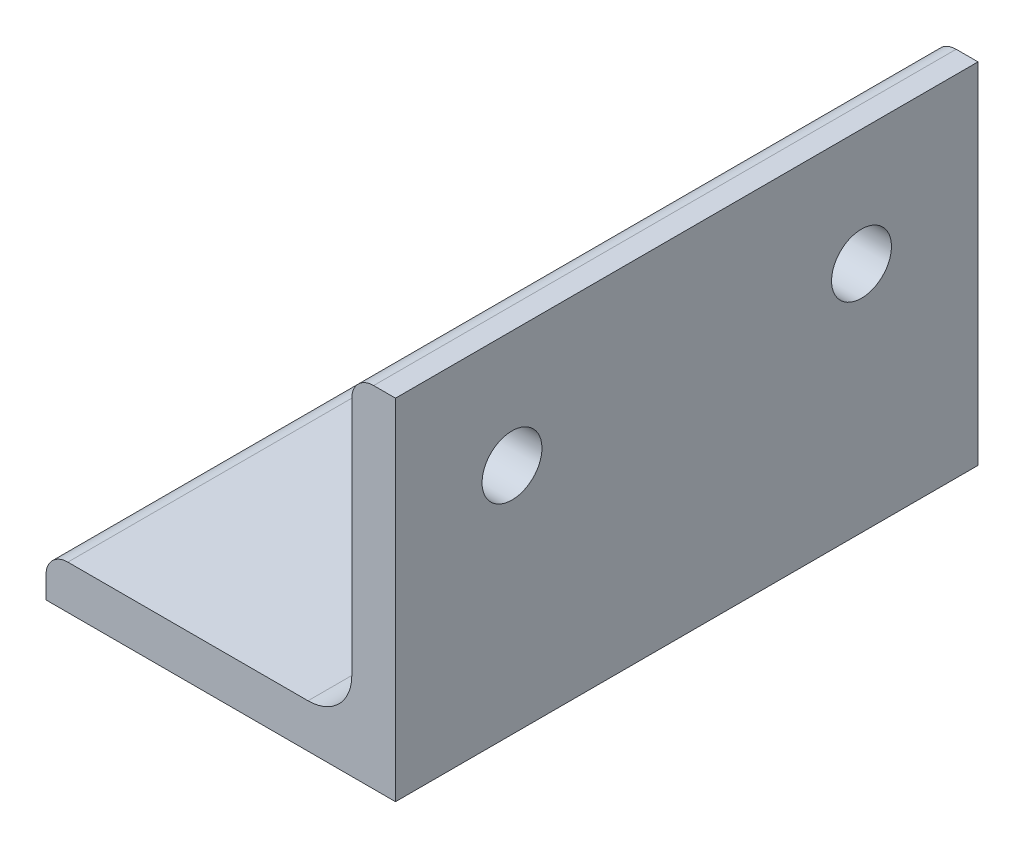
ISO-10303-21;
HEADER;
FILE_DESCRIPTION(('STEP AP214'),'2;1');
FILE_NAME('part.step','',(''),(''),'','','');
FILE_SCHEMA(('AUTOMOTIVE_DESIGN { 1 0 10303 214 1 1 1 1 }'));
ENDSEC;
DATA;
#1=APPLICATION_CONTEXT('core data for automotive mechanical design processes');
#2=APPLICATION_PROTOCOL_DEFINITION('international standard','automotive_design',2000,#1);
#3=PRODUCT_CONTEXT('',#1,'mechanical');
#4=PRODUCT('Part','Part','',(#3));
#5=PRODUCT_RELATED_PRODUCT_CATEGORY('part','',(#4));
#6=PRODUCT_DEFINITION_FORMATION('','',#4);
#7=PRODUCT_DEFINITION_CONTEXT('part definition',#1,'design');
#8=PRODUCT_DEFINITION('design','',#6,#7);
#9=PRODUCT_DEFINITION_SHAPE('','',#8);
#10=(LENGTH_UNIT() NAMED_UNIT(*) SI_UNIT(.MILLI.,.METRE.));
#11=(NAMED_UNIT(*) PLANE_ANGLE_UNIT() SI_UNIT($,.RADIAN.));
#12=(NAMED_UNIT(*) SI_UNIT($,.STERADIAN.) SOLID_ANGLE_UNIT());
#13=UNCERTAINTY_MEASURE_WITH_UNIT(LENGTH_MEASURE(1.E-05),#10,'distance_accuracy_value','');
#14=(GEOMETRIC_REPRESENTATION_CONTEXT(3) GLOBAL_UNCERTAINTY_ASSIGNED_CONTEXT((#13)) GLOBAL_UNIT_ASSIGNED_CONTEXT((#10,
#11,#12)) REPRESENTATION_CONTEXT('',''));
#15=CARTESIAN_POINT('',(0.,0.,0.));
#16=DIRECTION('',(0.,0.,1.));
#17=DIRECTION('',(1.,0.,0.));
#18=AXIS2_PLACEMENT_3D('',#15,#16,#17);
#19=CARTESIAN_POINT('',(-19.05,-16.66875,31.75));
#20=DIRECTION('',(1.,0.,0.));
#21=DIRECTION('',(0.,0.,-1.));
#22=AXIS2_PLACEMENT_3D('',#19,#20,#21);
#23=PLANE('',#22);
#24=DIRECTION('',(0.,-1.,0.));
#25=VECTOR('',#24,1.);
#26=CARTESIAN_POINT('',(-19.05,-16.66875,-31.75));
#27=LINE('',#26,#25);
#28=CARTESIAN_POINT('',(-19.05,-16.66875,-31.75));
#29=VERTEX_POINT('',#28);
#30=CARTESIAN_POINT('',(-19.05,-19.05,-31.75));
#31=VERTEX_POINT('',#30);
#32=EDGE_CURVE('E136',#29,#31,#27,.T.);
#33=ORIENTED_EDGE('',*,*,#32,.T.);
#34=DIRECTION('',(0.,0.,-1.));
#35=VECTOR('',#34,1.);
#36=CARTESIAN_POINT('',(-19.05,-19.05,31.75));
#37=LINE('',#36,#35);
#38=CARTESIAN_POINT('',(-19.05,-19.05,31.75));
#39=VERTEX_POINT('',#38);
#40=EDGE_CURVE('E11',#39,#31,#37,.T.);
#41=ORIENTED_EDGE('',*,*,#40,.F.);
#42=DIRECTION('',(0.,-1.,0.));
#43=VECTOR('',#42,1.);
#44=CARTESIAN_POINT('',(-19.05,-16.66875,31.75));
#45=LINE('',#44,#43);
#46=CARTESIAN_POINT('',(-19.05,-16.66875,31.75));
#47=VERTEX_POINT('',#46);
#48=EDGE_CURVE('E153',#47,#39,#45,.T.);
#49=ORIENTED_EDGE('',*,*,#48,.F.);
#50=DIRECTION('',(0.,0.,-1.));
#51=VECTOR('',#50,1.);
#52=CARTESIAN_POINT('',(-19.05,-16.66875,31.75));
#53=LINE('',#52,#51);
#54=EDGE_CURVE('E132',#47,#29,#53,.T.);
#55=ORIENTED_EDGE('',*,*,#54,.T.);
#56=EDGE_LOOP('',(#33,#41,#49,#55));
#57=FACE_BOUND('',#56,.T.);
#58=ADVANCED_FACE('F34',(#57),#23,.F.);
#59=CARTESIAN_POINT('',(-19.05,-19.05,31.75));
#60=DIRECTION('',(0.,1.,0.));
#61=DIRECTION('',(-1.,0.,0.));
#62=AXIS2_PLACEMENT_3D('',#59,#60,#61);
#63=PLANE('',#62);
#64=DIRECTION('',(1.,0.,0.));
#65=VECTOR('',#64,1.);
#66=CARTESIAN_POINT('',(-19.05,-19.05,-31.75));
#67=LINE('',#66,#65);
#68=CARTESIAN_POINT('',(19.05,-19.05,-31.75));
#69=VERTEX_POINT('',#68);
#70=EDGE_CURVE('E139',#31,#69,#67,.T.);
#71=ORIENTED_EDGE('',*,*,#70,.T.);
#72=DIRECTION('',(0.,0.,-1.));
#73=VECTOR('',#72,1.);
#74=CARTESIAN_POINT('',(19.05,-19.05,31.75));
#75=LINE('',#74,#73);
#76=CARTESIAN_POINT('',(19.05,-19.05,31.75));
#77=VERTEX_POINT('',#76);
#78=EDGE_CURVE('E42',#77,#69,#75,.T.);
#79=ORIENTED_EDGE('',*,*,#78,.F.);
#80=DIRECTION('',(1.,0.,0.));
#81=VECTOR('',#80,1.);
#82=CARTESIAN_POINT('',(-19.05,-19.05,31.75));
#83=LINE('',#82,#81);
#84=EDGE_CURVE('E96',#39,#77,#83,.T.);
#85=ORIENTED_EDGE('',*,*,#84,.F.);
#86=ORIENTED_EDGE('',*,*,#40,.T.);
#87=EDGE_LOOP('',(#71,#79,#85,#86));
#88=FACE_BOUND('',#87,.T.);
#89=ADVANCED_FACE('F229',(#88),#63,.F.);
#90=CARTESIAN_POINT('',(19.05,-19.05,31.75));
#91=DIRECTION('',(-1.,0.,0.));
#92=DIRECTION('',(0.,-1.,0.));
#93=AXIS2_PLACEMENT_3D('',#90,#91,#92);
#94=PLANE('',#93);
#95=CARTESIAN_POINT('',(19.05,6.34999999999988,-19.0500000000013));
#96=DIRECTION('',(-1.,0.,0.));
#97=DIRECTION('',(0.,-1.,0.));
#98=AXIS2_PLACEMENT_3D('',#95,#96,#97);
#99=CIRCLE('',#98,3.2639);
#100=CARTESIAN_POINT('',(19.05,3.08609999999987,-19.0500000000013));
#101=VERTEX_POINT('',#100);
#102=EDGE_CURVE('E140',#101,#101,#99,.F.);
#103=ORIENTED_EDGE('',*,*,#102,.F.);
#104=EDGE_LOOP('',(#103));
#105=FACE_BOUND('',#104,.T.);
#106=CARTESIAN_POINT('',(19.05,6.35000000000014,19.0499999999987));
#107=DIRECTION('',(-1.,0.,0.));
#108=DIRECTION('',(0.,-1.,0.));
#109=AXIS2_PLACEMENT_3D('',#106,#107,#108);
#110=CIRCLE('',#109,3.2639);
#111=CARTESIAN_POINT('',(19.05,3.08610000000014,19.0499999999987));
#112=VERTEX_POINT('',#111);
#113=EDGE_CURVE('E194',#112,#112,#110,.F.);
#114=ORIENTED_EDGE('',*,*,#113,.F.);
#115=EDGE_LOOP('',(#114));
#116=FACE_BOUND('',#115,.T.);
#117=DIRECTION('',(0.,1.,0.));
#118=VECTOR('',#117,1.);
#119=CARTESIAN_POINT('',(19.05,-19.05,-31.75));
#120=LINE('',#119,#118);
#121=CARTESIAN_POINT('',(19.05,19.05,-31.75));
#122=VERTEX_POINT('',#121);
#123=EDGE_CURVE('E142',#69,#122,#120,.T.);
#124=ORIENTED_EDGE('',*,*,#123,.T.);
#125=DIRECTION('',(0.,0.,-1.));
#126=VECTOR('',#125,1.);
#127=CARTESIAN_POINT('',(19.05,19.05,31.75));
#128=LINE('',#127,#126);
#129=CARTESIAN_POINT('',(19.05,19.05,31.75));
#130=VERTEX_POINT('',#129);
#131=EDGE_CURVE('E163',#130,#122,#128,.T.);
#132=ORIENTED_EDGE('',*,*,#131,.F.);
#133=DIRECTION('',(0.,1.,0.));
#134=VECTOR('',#133,1.);
#135=CARTESIAN_POINT('',(19.05,-19.05,31.75));
#136=LINE('',#135,#134);
#137=EDGE_CURVE('E171',#77,#130,#136,.T.);
#138=ORIENTED_EDGE('',*,*,#137,.F.);
#139=ORIENTED_EDGE('',*,*,#78,.T.);
#140=EDGE_LOOP('',(#124,#132,#138,#139));
#141=FACE_BOUND('',#140,.T.);
#142=ADVANCED_FACE('F169',(#105,#116,#141),#94,.F.);
#143=CARTESIAN_POINT('',(16.66875,19.05,31.75));
#144=DIRECTION('',(0.,-1.,0.));
#145=DIRECTION('',(1.,0.,0.));
#146=AXIS2_PLACEMENT_3D('',#143,#144,#145);
#147=PLANE('',#146);
#148=DIRECTION('',(-1.,0.,0.));
#149=VECTOR('',#148,1.);
#150=CARTESIAN_POINT('',(16.66875,19.05,-31.75));
#151=LINE('',#150,#149);
#152=CARTESIAN_POINT('',(16.66875,19.05,-31.75));
#153=VERTEX_POINT('',#152);
#154=EDGE_CURVE('E144',#122,#153,#151,.T.);
#155=ORIENTED_EDGE('',*,*,#154,.T.);
#156=DIRECTION('',(0.,0.,-1.));
#157=VECTOR('',#156,1.);
#158=CARTESIAN_POINT('',(16.66875,19.05,31.75));
#159=LINE('',#158,#157);
#160=CARTESIAN_POINT('',(16.66875,19.05,31.75));
#161=VERTEX_POINT('',#160);
#162=EDGE_CURVE('E160',#161,#153,#159,.T.);
#163=ORIENTED_EDGE('',*,*,#162,.F.);
#164=DIRECTION('',(-1.,0.,0.));
#165=VECTOR('',#164,1.);
#166=CARTESIAN_POINT('',(16.66875,19.05,31.75));
#167=LINE('',#166,#165);
#168=EDGE_CURVE('E187',#130,#161,#167,.T.);
#169=ORIENTED_EDGE('',*,*,#168,.F.);
#170=ORIENTED_EDGE('',*,*,#131,.T.);
#171=EDGE_LOOP('',(#155,#163,#169,#170));
#172=FACE_BOUND('',#171,.T.);
#173=ADVANCED_FACE('F180',(#172),#147,.F.);
#174=CARTESIAN_POINT('',(16.66875,16.66875,31.75));
#175=DIRECTION('',(0.,0.,-1.));
#176=DIRECTION('',(-1.,0.,0.));
#177=AXIS2_PLACEMENT_3D('',#174,#175,#176);
#178=CYLINDRICAL_SURFACE('',#177,2.38125);
#179=CARTESIAN_POINT('',(16.66875,16.66875,-31.75));
#180=DIRECTION('',(0.,0.,1.));
#181=DIRECTION('',(-1.,0.,0.));
#182=AXIS2_PLACEMENT_3D('',#179,#180,#181);
#183=CIRCLE('',#182,2.38125);
#184=CARTESIAN_POINT('',(14.2875,16.66875,-31.75));
#185=VERTEX_POINT('',#184);
#186=EDGE_CURVE('E146',#153,#185,#183,.T.);
#187=ORIENTED_EDGE('',*,*,#186,.T.);
#188=DIRECTION('',(0.,0.,-1.));
#189=VECTOR('',#188,1.);
#190=CARTESIAN_POINT('',(14.2875,16.66875,31.75));
#191=LINE('',#190,#189);
#192=CARTESIAN_POINT('',(14.2875,16.66875,31.75));
#193=VERTEX_POINT('',#192);
#194=EDGE_CURVE('E157',#193,#185,#191,.T.);
#195=ORIENTED_EDGE('',*,*,#194,.F.);
#196=CARTESIAN_POINT('',(16.66875,16.66875,31.75));
#197=DIRECTION('',(0.,0.,1.));
#198=DIRECTION('',(-1.,0.,0.));
#199=AXIS2_PLACEMENT_3D('',#196,#197,#198);
#200=CIRCLE('',#199,2.38125);
#201=EDGE_CURVE('E186',#161,#193,#200,.T.);
#202=ORIENTED_EDGE('',*,*,#201,.F.);
#203=ORIENTED_EDGE('',*,*,#162,.T.);
#204=EDGE_LOOP('',(#187,#195,#202,#203));
#205=FACE_BOUND('',#204,.T.);
#206=ADVANCED_FACE('F184',(#205),#178,.T.);
#207=CARTESIAN_POINT('',(14.2875,16.66875,31.75));
#208=DIRECTION('',(1.,0.,0.));
#209=DIRECTION('',(0.,1.,0.));
#210=AXIS2_PLACEMENT_3D('',#207,#208,#209);
#211=PLANE('',#210);
#212=CARTESIAN_POINT('',(14.2875,6.34999999999988,-19.0500000000013));
#213=DIRECTION('',(-1.,0.,0.));
#214=DIRECTION('',(0.,-1.,0.));
#215=AXIS2_PLACEMENT_3D('',#212,#213,#214);
#216=CIRCLE('',#215,3.2639);
#217=CARTESIAN_POINT('',(14.2875,3.08609999999987,-19.0500000000013));
#218=VERTEX_POINT('',#217);
#219=EDGE_CURVE('E197',#218,#218,#216,.T.);
#220=ORIENTED_EDGE('',*,*,#219,.F.);
#221=EDGE_LOOP('',(#220));
#222=FACE_BOUND('',#221,.T.);
#223=CARTESIAN_POINT('',(14.2875,6.35000000000014,19.0499999999987));
#224=DIRECTION('',(-1.,0.,0.));
#225=DIRECTION('',(0.,-1.,0.));
#226=AXIS2_PLACEMENT_3D('',#223,#224,#225);
#227=CIRCLE('',#226,3.2639);
#228=CARTESIAN_POINT('',(14.2875,3.08610000000014,19.0499999999987));
#229=VERTEX_POINT('',#228);
#230=EDGE_CURVE('E198',#229,#229,#227,.T.);
#231=ORIENTED_EDGE('',*,*,#230,.F.);
#232=EDGE_LOOP('',(#231));
#233=FACE_BOUND('',#232,.T.);
#234=DIRECTION('',(0.,-1.,0.));
#235=VECTOR('',#234,1.);
#236=CARTESIAN_POINT('',(14.2875,16.66875,-31.75));
#237=LINE('',#236,#235);
#238=CARTESIAN_POINT('',(14.2875,-9.5123,-31.75));
#239=VERTEX_POINT('',#238);
#240=EDGE_CURVE('E148',#185,#239,#237,.T.);
#241=ORIENTED_EDGE('',*,*,#240,.T.);
#242=DIRECTION('',(0.,0.,-1.));
#243=VECTOR('',#242,1.);
#244=CARTESIAN_POINT('',(14.2875,-9.5123,31.75));
#245=LINE('',#244,#243);
#246=CARTESIAN_POINT('',(14.2875,-9.5123,31.75));
#247=VERTEX_POINT('',#246);
#248=EDGE_CURVE('E127',#247,#239,#245,.T.);
#249=ORIENTED_EDGE('',*,*,#248,.F.);
#250=DIRECTION('',(0.,-1.,0.));
#251=VECTOR('',#250,1.);
#252=CARTESIAN_POINT('',(14.2875,16.66875,31.75));
#253=LINE('',#252,#251);
#254=EDGE_CURVE('E118',#193,#247,#253,.T.);
#255=ORIENTED_EDGE('',*,*,#254,.F.);
#256=ORIENTED_EDGE('',*,*,#194,.T.);
#257=EDGE_LOOP('',(#241,#249,#255,#256));
#258=FACE_BOUND('',#257,.T.);
#259=ADVANCED_FACE('F209',(#222,#233,#258),#211,.F.);
#260=CARTESIAN_POINT('',(9.51230000000001,-9.5123,31.75));
#261=DIRECTION('',(0.,0.,-1.));
#262=DIRECTION('',(-1.,0.,0.));
#263=AXIS2_PLACEMENT_3D('',#260,#261,#262);
#264=CYLINDRICAL_SURFACE('',#263,4.7752);
#265=CARTESIAN_POINT('',(9.51230000000001,-9.5123,-31.75));
#266=DIRECTION('',(0.,0.,-1.));
#267=DIRECTION('',(-1.,0.,0.));
#268=AXIS2_PLACEMENT_3D('',#265,#266,#267);
#269=CIRCLE('',#268,4.7752);
#270=CARTESIAN_POINT('',(9.51230000000001,-14.2875,-31.75));
#271=VERTEX_POINT('',#270);
#272=EDGE_CURVE('E126',#239,#271,#269,.T.);
#273=ORIENTED_EDGE('',*,*,#272,.T.);
#274=DIRECTION('',(0.,0.,-1.));
#275=VECTOR('',#274,1.);
#276=CARTESIAN_POINT('',(9.51230000000001,-14.2875,31.75));
#277=LINE('',#276,#275);
#278=CARTESIAN_POINT('',(9.51230000000001,-14.2875,31.75));
#279=VERTEX_POINT('',#278);
#280=EDGE_CURVE('E123',#279,#271,#277,.T.);
#281=ORIENTED_EDGE('',*,*,#280,.F.);
#282=CARTESIAN_POINT('',(9.51230000000001,-9.5123,31.75));
#283=DIRECTION('',(0.,0.,-1.));
#284=DIRECTION('',(-1.,0.,0.));
#285=AXIS2_PLACEMENT_3D('',#282,#283,#284);
#286=CIRCLE('',#285,4.7752);
#287=EDGE_CURVE('E112',#247,#279,#286,.T.);
#288=ORIENTED_EDGE('',*,*,#287,.F.);
#289=ORIENTED_EDGE('',*,*,#248,.T.);
#290=EDGE_LOOP('',(#273,#281,#288,#289));
#291=FACE_BOUND('',#290,.T.);
#292=ADVANCED_FACE('F124',(#291),#264,.F.);
#293=CARTESIAN_POINT('',(9.51230000000001,-14.2875,31.75));
#294=DIRECTION('',(0.,-1.,0.));
#295=DIRECTION('',(0.,0.,-1.));
#296=AXIS2_PLACEMENT_3D('',#293,#294,#295);
#297=PLANE('',#296);
#298=DIRECTION('',(-1.,0.,0.));
#299=VECTOR('',#298,1.);
#300=CARTESIAN_POINT('',(9.51230000000001,-14.2875,-31.75));
#301=LINE('',#300,#299);
#302=CARTESIAN_POINT('',(-16.66875,-14.2875,-31.75));
#303=VERTEX_POINT('',#302);
#304=EDGE_CURVE('E82',#271,#303,#301,.T.);
#305=ORIENTED_EDGE('',*,*,#304,.T.);
#306=DIRECTION('',(0.,0.,-1.));
#307=VECTOR('',#306,1.);
#308=CARTESIAN_POINT('',(-16.66875,-14.2875,31.75));
#309=LINE('',#308,#307);
#310=CARTESIAN_POINT('',(-16.66875,-14.2875,31.75));
#311=VERTEX_POINT('',#310);
#312=EDGE_CURVE('E128',#311,#303,#309,.T.);
#313=ORIENTED_EDGE('',*,*,#312,.F.);
#314=DIRECTION('',(-1.,0.,0.));
#315=VECTOR('',#314,1.);
#316=CARTESIAN_POINT('',(9.51230000000001,-14.2875,31.75));
#317=LINE('',#316,#315);
#318=EDGE_CURVE('E116',#279,#311,#317,.T.);
#319=ORIENTED_EDGE('',*,*,#318,.F.);
#320=ORIENTED_EDGE('',*,*,#280,.T.);
#321=EDGE_LOOP('',(#305,#313,#319,#320));
#322=FACE_BOUND('',#321,.T.);
#323=ADVANCED_FACE('F130',(#322),#297,.F.);
#324=CARTESIAN_POINT('',(-16.66875,-16.66875,31.75));
#325=DIRECTION('',(0.,0.,-1.));
#326=DIRECTION('',(-1.,0.,0.));
#327=AXIS2_PLACEMENT_3D('',#324,#325,#326);
#328=CYLINDRICAL_SURFACE('',#327,2.38125);
#329=CARTESIAN_POINT('',(-16.66875,-16.66875,-31.75));
#330=DIRECTION('',(0.,0.,1.));
#331=DIRECTION('',(-1.,0.,0.));
#332=AXIS2_PLACEMENT_3D('',#329,#330,#331);
#333=CIRCLE('',#332,2.38125);
#334=EDGE_CURVE('E88',#303,#29,#333,.T.);
#335=ORIENTED_EDGE('',*,*,#334,.T.);
#336=ORIENTED_EDGE('',*,*,#54,.F.);
#337=CARTESIAN_POINT('',(-16.66875,-16.66875,31.75));
#338=DIRECTION('',(0.,0.,1.));
#339=DIRECTION('',(-1.,0.,0.));
#340=AXIS2_PLACEMENT_3D('',#337,#338,#339);
#341=CIRCLE('',#340,2.38125);
#342=EDGE_CURVE('E50',#311,#47,#341,.T.);
#343=ORIENTED_EDGE('',*,*,#342,.F.);
#344=ORIENTED_EDGE('',*,*,#312,.T.);
#345=EDGE_LOOP('',(#335,#336,#343,#344));
#346=FACE_BOUND('',#345,.T.);
#347=ADVANCED_FACE('F218',(#346),#328,.T.);
#348=CARTESIAN_POINT('',(16.66875,16.66875,31.75));
#349=DIRECTION('',(0.,0.,-1.));
#350=DIRECTION('',(-1.,0.,0.));
#351=AXIS2_PLACEMENT_3D('',#348,#349,#350);
#352=PLANE('',#351);
#353=ORIENTED_EDGE('',*,*,#48,.T.);
#354=ORIENTED_EDGE('',*,*,#84,.T.);
#355=ORIENTED_EDGE('',*,*,#137,.T.);
#356=ORIENTED_EDGE('',*,*,#168,.T.);
#357=ORIENTED_EDGE('',*,*,#201,.T.);
#358=ORIENTED_EDGE('',*,*,#254,.T.);
#359=ORIENTED_EDGE('',*,*,#287,.T.);
#360=ORIENTED_EDGE('',*,*,#318,.T.);
#361=ORIENTED_EDGE('',*,*,#342,.T.);
#362=EDGE_LOOP('',(#353,#354,#355,#356,#357,#358,#359,#360,#361));
#363=FACE_BOUND('',#362,.T.);
#364=ADVANCED_FACE('F114',(#363),#352,.F.);
#365=CARTESIAN_POINT('',(16.66875,16.66875,-31.75));
#366=DIRECTION('',(0.,0.,-1.));
#367=DIRECTION('',(-1.,0.,0.));
#368=AXIS2_PLACEMENT_3D('',#365,#366,#367);
#369=PLANE('',#368);
#370=ORIENTED_EDGE('',*,*,#32,.F.);
#371=ORIENTED_EDGE('',*,*,#334,.F.);
#372=ORIENTED_EDGE('',*,*,#304,.F.);
#373=ORIENTED_EDGE('',*,*,#272,.F.);
#374=ORIENTED_EDGE('',*,*,#240,.F.);
#375=ORIENTED_EDGE('',*,*,#186,.F.);
#376=ORIENTED_EDGE('',*,*,#154,.F.);
#377=ORIENTED_EDGE('',*,*,#123,.F.);
#378=ORIENTED_EDGE('',*,*,#70,.F.);
#379=EDGE_LOOP('',(#370,#371,#372,#373,#374,#375,#376,#377,#378));
#380=FACE_BOUND('',#379,.T.);
#381=ADVANCED_FACE('F175',(#380),#369,.T.);
#382=CARTESIAN_POINT('',(19.051,6.35000000000014,19.0499999999987));
#383=DIRECTION('',(-1.,0.,0.));
#384=DIRECTION('',(0.,-1.,0.));
#385=AXIS2_PLACEMENT_3D('',#382,#383,#384);
#386=CYLINDRICAL_SURFACE('',#385,3.2639);
#387=ORIENTED_EDGE('',*,*,#230,.T.);
#388=EDGE_LOOP('',(#387));
#389=FACE_BOUND('',#388,.T.);
#390=ORIENTED_EDGE('',*,*,#113,.T.);
#391=EDGE_LOOP('',(#390));
#392=FACE_BOUND('',#391,.T.);
#393=ADVANCED_FACE('F272',(#389,#392),#386,.F.);
#394=CARTESIAN_POINT('',(19.051,6.34999999999988,-19.0500000000013));
#395=DIRECTION('',(-1.,0.,0.));
#396=DIRECTION('',(0.,-1.,0.));
#397=AXIS2_PLACEMENT_3D('',#394,#395,#396);
#398=CYLINDRICAL_SURFACE('',#397,3.2639);
#399=ORIENTED_EDGE('',*,*,#219,.T.);
#400=EDGE_LOOP('',(#399));
#401=FACE_BOUND('',#400,.T.);
#402=ORIENTED_EDGE('',*,*,#102,.T.);
#403=EDGE_LOOP('',(#402));
#404=FACE_BOUND('',#403,.T.);
#405=ADVANCED_FACE('F206',(#401,#404),#398,.F.);
#406=CLOSED_SHELL('',(#58,#89,#142,#173,#206,#259,#292,#323,#347,#364,#381,#393,#405));
#407=MANIFOLD_SOLID_BREP('B2',#406);
#408=ADVANCED_BREP_SHAPE_REPRESENTATION('',(#18,#407),#14);
#409=SHAPE_DEFINITION_REPRESENTATION(#9,#408);
ENDSEC;
END-ISO-10303-21;
